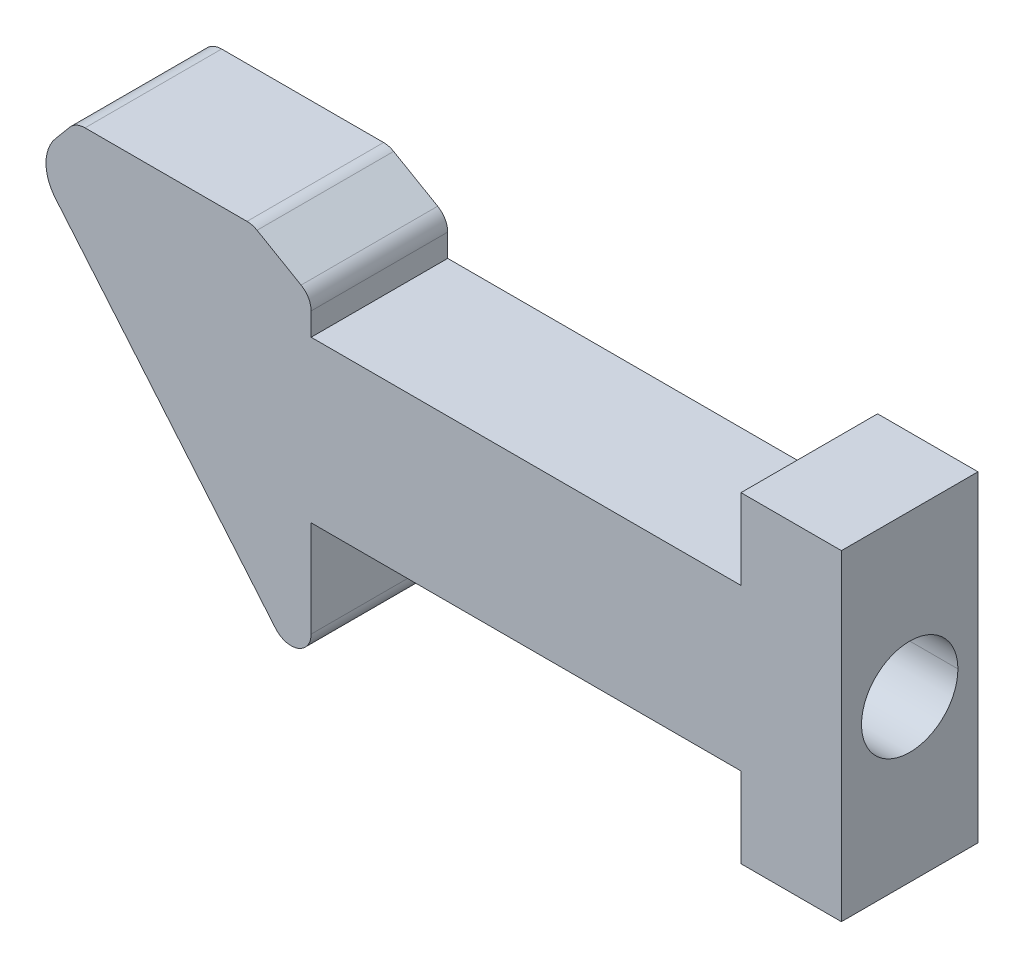
ISO-10303-21;
HEADER;
FILE_DESCRIPTION(('STEP AP214'),'2;1');
FILE_NAME('part.step','',(''),(''),'','','');
FILE_SCHEMA(('AUTOMOTIVE_DESIGN { 1 0 10303 214 1 1 1 1 }'));
ENDSEC;
DATA;
#1=APPLICATION_CONTEXT('core data for automotive mechanical design processes');
#2=APPLICATION_PROTOCOL_DEFINITION('international standard','automotive_design',2000,#1);
#3=PRODUCT_CONTEXT('',#1,'mechanical');
#4=PRODUCT('Part','Part','',(#3));
#5=PRODUCT_RELATED_PRODUCT_CATEGORY('part','',(#4));
#6=PRODUCT_DEFINITION_FORMATION('','',#4);
#7=PRODUCT_DEFINITION_CONTEXT('part definition',#1,'design');
#8=PRODUCT_DEFINITION('design','',#6,#7);
#9=PRODUCT_DEFINITION_SHAPE('','',#8);
#10=(LENGTH_UNIT() NAMED_UNIT(*) SI_UNIT(.MILLI.,.METRE.));
#11=(NAMED_UNIT(*) PLANE_ANGLE_UNIT() SI_UNIT($,.RADIAN.));
#12=(NAMED_UNIT(*) SI_UNIT($,.STERADIAN.) SOLID_ANGLE_UNIT());
#13=UNCERTAINTY_MEASURE_WITH_UNIT(LENGTH_MEASURE(1.E-05),#10,'distance_accuracy_value','');
#14=(GEOMETRIC_REPRESENTATION_CONTEXT(3) GLOBAL_UNCERTAINTY_ASSIGNED_CONTEXT((#13)) GLOBAL_UNIT_ASSIGNED_CONTEXT((#10,
#11,#12)) REPRESENTATION_CONTEXT('',''));
#15=CARTESIAN_POINT('',(0.,0.,0.));
#16=DIRECTION('',(0.,0.,1.));
#17=DIRECTION('',(1.,0.,0.));
#18=AXIS2_PLACEMENT_3D('',#15,#16,#17);
#19=CARTESIAN_POINT('',(-9.5,0.,0.));
#20=DIRECTION('',(1.,0.,0.));
#21=DIRECTION('',(0.,0.,-1.));
#22=AXIS2_PLACEMENT_3D('',#19,#20,#21);
#23=CYLINDRICAL_SURFACE('',#22,0.95);
#24=CARTESIAN_POINT('',(-9.5,0.,0.));
#25=DIRECTION('',(1.,0.,0.));
#26=DIRECTION('',(0.,0.,-1.));
#27=AXIS2_PLACEMENT_3D('',#24,#25,#26);
#28=CIRCLE('',#27,0.95);
#29=CARTESIAN_POINT('',(-9.5,0.,0.95));
#30=VERTEX_POINT('',#29);
#31=CARTESIAN_POINT('',(-9.5,0.,-0.95));
#32=VERTEX_POINT('',#31);
#33=EDGE_CURVE('E363',#30,#32,#28,.T.);
#34=ORIENTED_EDGE('',*,*,#33,.F.);
#35=DIRECTION('',(1.,0.,0.));
#36=VECTOR('',#35,1.);
#37=CARTESIAN_POINT('',(-9.5,0.,0.95));
#38=LINE('',#37,#36);
#39=CARTESIAN_POINT('',(-2.8,0.,0.95));
#40=VERTEX_POINT('',#39);
#41=EDGE_CURVE('E343',#30,#40,#38,.T.);
#42=ORIENTED_EDGE('',*,*,#41,.T.);
#43=CARTESIAN_POINT('',(-2.8,0.,0.));
#44=DIRECTION('',(-1.,0.,0.));
#45=DIRECTION('',(0.,0.,-1.));
#46=AXIS2_PLACEMENT_3D('',#43,#44,#45);
#47=CIRCLE('',#46,0.95);
#48=CARTESIAN_POINT('',(-2.8,0.,-0.95));
#49=VERTEX_POINT('',#48);
#50=EDGE_CURVE('E289',#49,#40,#47,.T.);
#51=ORIENTED_EDGE('',*,*,#50,.F.);
#52=DIRECTION('',(1.,0.,0.));
#53=VECTOR('',#52,1.);
#54=CARTESIAN_POINT('',(-9.5,0.,-0.95));
#55=LINE('',#54,#53);
#56=EDGE_CURVE('E364',#32,#49,#55,.T.);
#57=ORIENTED_EDGE('',*,*,#56,.F.);
#58=EDGE_LOOP('',(#34,#42,#51,#57));
#59=FACE_BOUND('',#58,.T.);
#60=ADVANCED_FACE('F15',(#59),#23,.F.);
#61=CARTESIAN_POINT('',(-2.8,0.,0.));
#62=DIRECTION('',(1.,0.,0.));
#63=DIRECTION('',(0.,0.,-1.));
#64=AXIS2_PLACEMENT_3D('',#61,#62,#63);
#65=CYLINDRICAL_SURFACE('',#64,1.2);
#66=CARTESIAN_POINT('',(-2.8,0.,0.));
#67=DIRECTION('',(1.,0.,0.));
#68=DIRECTION('',(0.,0.,-1.));
#69=AXIS2_PLACEMENT_3D('',#66,#67,#68);
#70=CIRCLE('',#69,1.2);
#71=CARTESIAN_POINT('',(-2.8,0.,1.2));
#72=VERTEX_POINT('',#71);
#73=CARTESIAN_POINT('',(-2.8,0.,-1.2));
#74=VERTEX_POINT('',#73);
#75=EDGE_CURVE('E286',#72,#74,#70,.T.);
#76=ORIENTED_EDGE('',*,*,#75,.F.);
#77=DIRECTION('',(1.,0.,0.));
#78=VECTOR('',#77,1.);
#79=CARTESIAN_POINT('',(-2.8,0.,1.2));
#80=LINE('',#79,#78);
#81=CARTESIAN_POINT('',(0.,0.,1.2));
#82=VERTEX_POINT('',#81);
#83=EDGE_CURVE('E503',#72,#82,#80,.T.);
#84=ORIENTED_EDGE('',*,*,#83,.T.);
#85=CARTESIAN_POINT('',(0.,0.,0.));
#86=DIRECTION('',(1.,0.,0.));
#87=DIRECTION('',(0.,0.,-1.));
#88=AXIS2_PLACEMENT_3D('',#85,#86,#87);
#89=CIRCLE('',#88,1.2);
#90=CARTESIAN_POINT('',(0.,0.,-1.2));
#91=VERTEX_POINT('',#90);
#92=EDGE_CURVE('E255',#82,#91,#89,.T.);
#93=ORIENTED_EDGE('',*,*,#92,.T.);
#94=DIRECTION('',(1.,0.,0.));
#95=VECTOR('',#94,1.);
#96=CARTESIAN_POINT('',(-2.8,0.,-1.2));
#97=LINE('',#96,#95);
#98=EDGE_CURVE('E304',#74,#91,#97,.T.);
#99=ORIENTED_EDGE('',*,*,#98,.F.);
#100=EDGE_LOOP('',(#76,#84,#93,#99));
#101=FACE_BOUND('',#100,.T.);
#102=ADVANCED_FACE('F800',(#101),#65,.F.);
#103=CARTESIAN_POINT('',(-18.8,2.45580523566075,1.7));
#104=DIRECTION('',(0.,0.,-1.));
#105=DIRECTION('',(-1.,0.,0.));
#106=AXIS2_PLACEMENT_3D('',#103,#104,#105);
#107=CYLINDRICAL_SURFACE('',#106,1.);
#108=CARTESIAN_POINT('',(-18.8,2.45580523566075,1.7));
#109=DIRECTION('',(0.,0.,1.));
#110=DIRECTION('',(-1.,0.,0.));
#111=AXIS2_PLACEMENT_3D('',#108,#109,#110);
#112=CIRCLE('',#111,1.);
#113=CARTESIAN_POINT('',(-19.8,2.45580523566075,1.7));
#114=VERTEX_POINT('',#113);
#115=CARTESIAN_POINT('',(-19.5660444431189,1.81301762597422,1.7));
#116=VERTEX_POINT('',#115);
#117=EDGE_CURVE('E423',#114,#116,#112,.T.);
#118=ORIENTED_EDGE('',*,*,#117,.F.);
#119=DIRECTION('',(0.,0.,-1.));
#120=VECTOR('',#119,1.);
#121=CARTESIAN_POINT('',(-19.8,2.45580523566075,1.7));
#122=LINE('',#121,#120);
#123=CARTESIAN_POINT('',(-19.8,2.45580523566075,-1.7));
#124=VERTEX_POINT('',#123);
#125=EDGE_CURVE('E10',#114,#124,#122,.T.);
#126=ORIENTED_EDGE('',*,*,#125,.T.);
#127=CARTESIAN_POINT('',(-18.8,2.45580523566075,-1.7));
#128=DIRECTION('',(0.,0.,1.));
#129=DIRECTION('',(-1.,0.,0.));
#130=AXIS2_PLACEMENT_3D('',#127,#128,#129);
#131=CIRCLE('',#130,1.);
#132=CARTESIAN_POINT('',(-19.5660444431189,1.81301762597422,-1.7));
#133=VERTEX_POINT('',#132);
#134=EDGE_CURVE('E306',#124,#133,#131,.T.);
#135=ORIENTED_EDGE('',*,*,#134,.T.);
#136=DIRECTION('',(0.,0.,-1.));
#137=VECTOR('',#136,1.);
#138=CARTESIAN_POINT('',(-19.5660444431189,1.81301762597422,1.7));
#139=LINE('',#138,#137);
#140=EDGE_CURVE('E26',#116,#133,#139,.T.);
#141=ORIENTED_EDGE('',*,*,#140,.F.);
#142=EDGE_LOOP('',(#118,#126,#135,#141));
#143=FACE_BOUND('',#142,.T.);
#144=ADVANCED_FACE('F17',(#143),#107,.T.);
#145=CARTESIAN_POINT('',(-18.8,2.45580523566075,1.7));
#146=DIRECTION('',(0.,0.,-1.));
#147=DIRECTION('',(-1.,0.,0.));
#148=AXIS2_PLACEMENT_3D('',#145,#146,#147);
#149=CYLINDRICAL_SURFACE('',#148,1.);
#150=ORIENTED_EDGE('',*,*,#125,.F.);
#151=CARTESIAN_POINT('',(-18.8,2.45580523566075,1.7));
#152=DIRECTION('',(0.,0.,1.));
#153=DIRECTION('',(-1.,0.,0.));
#154=AXIS2_PLACEMENT_3D('',#151,#152,#153);
#155=CIRCLE('',#154,1.);
#156=CARTESIAN_POINT('',(-19.566044443119,3.09859284534729,1.7));
#157=VERTEX_POINT('',#156);
#158=EDGE_CURVE('E310',#157,#114,#155,.T.);
#159=ORIENTED_EDGE('',*,*,#158,.F.);
#160=DIRECTION('',(0.,0.,-1.));
#161=VECTOR('',#160,1.);
#162=CARTESIAN_POINT('',(-19.566044443119,3.09859284534729,1.7));
#163=LINE('',#162,#161);
#164=CARTESIAN_POINT('',(-19.566044443119,3.09859284534729,-1.7));
#165=VERTEX_POINT('',#164);
#166=EDGE_CURVE('E389',#157,#165,#163,.T.);
#167=ORIENTED_EDGE('',*,*,#166,.T.);
#168=CARTESIAN_POINT('',(-18.8,2.45580523566075,-1.7));
#169=DIRECTION('',(0.,0.,1.));
#170=DIRECTION('',(-1.,0.,0.));
#171=AXIS2_PLACEMENT_3D('',#168,#169,#170);
#172=CIRCLE('',#171,1.);
#173=EDGE_CURVE('E297',#165,#124,#172,.T.);
#174=ORIENTED_EDGE('',*,*,#173,.T.);
#175=EDGE_LOOP('',(#150,#159,#167,#174));
#176=FACE_BOUND('',#175,.T.);
#177=ADVANCED_FACE('F483',(#176),#149,.T.);
#178=CARTESIAN_POINT('',(-19.5660444431189,1.81301762597422,1.7));
#179=DIRECTION('',(0.766044443118981,0.642787609686536,0.));
#180=DIRECTION('',(0.,0.,-1.));
#181=AXIS2_PLACEMENT_3D('',#178,#179,#180);
#182=PLANE('',#181);
#183=DIRECTION('',(0.642787609686535,-0.766044443118982,0.));
#184=VECTOR('',#183,1.);
#185=CARTESIAN_POINT('',(-19.5660444431189,1.81301762597422,-1.7));
#186=LINE('',#185,#184);
#187=CARTESIAN_POINT('',(-14.0830222215595,-4.72139380484327,-1.7));
#188=VERTEX_POINT('',#187);
#189=EDGE_CURVE('E311',#133,#188,#186,.T.);
#190=ORIENTED_EDGE('',*,*,#189,.T.);
#191=DIRECTION('',(0.,0.,-1.));
#192=VECTOR('',#191,1.);
#193=CARTESIAN_POINT('',(-14.0830222215595,-4.72139380484327,1.7));
#194=LINE('',#193,#192);
#195=CARTESIAN_POINT('',(-14.0830222215595,-4.72139380484327,1.7));
#196=VERTEX_POINT('',#195);
#197=EDGE_CURVE('E403',#196,#188,#194,.T.);
#198=ORIENTED_EDGE('',*,*,#197,.F.);
#199=DIRECTION('',(0.642787609686535,-0.766044443118982,0.));
#200=VECTOR('',#199,1.);
#201=CARTESIAN_POINT('',(-19.5660444431189,1.81301762597422,1.7));
#202=LINE('',#201,#200);
#203=EDGE_CURVE('E281',#116,#196,#202,.T.);
#204=ORIENTED_EDGE('',*,*,#203,.F.);
#205=ORIENTED_EDGE('',*,*,#140,.T.);
#206=EDGE_LOOP('',(#190,#198,#204,#205));
#207=FACE_BOUND('',#206,.T.);
#208=ADVANCED_FACE('F479',(#207),#182,.F.);
#209=CARTESIAN_POINT('',(-13.7,-4.4,1.7));
#210=DIRECTION('',(0.,0.,-1.));
#211=DIRECTION('',(-1.,0.,0.));
#212=AXIS2_PLACEMENT_3D('',#209,#210,#211);
#213=CYLINDRICAL_SURFACE('',#212,0.5);
#214=CARTESIAN_POINT('',(-13.7,-4.4,-1.7));
#215=DIRECTION('',(0.,0.,1.));
#216=DIRECTION('',(1.,0.,0.));
#217=AXIS2_PLACEMENT_3D('',#214,#215,#216);
#218=CIRCLE('',#217,0.5);
#219=CARTESIAN_POINT('',(-13.2,-4.4,-1.7));
#220=VERTEX_POINT('',#219);
#221=EDGE_CURVE('E294',#188,#220,#218,.T.);
#222=ORIENTED_EDGE('',*,*,#221,.T.);
#223=DIRECTION('',(0.,0.,-1.));
#224=VECTOR('',#223,1.);
#225=CARTESIAN_POINT('',(-13.2,-4.4,1.7));
#226=LINE('',#225,#224);
#227=CARTESIAN_POINT('',(-13.2,-4.4,1.7));
#228=VERTEX_POINT('',#227);
#229=EDGE_CURVE('E406',#228,#220,#226,.T.);
#230=ORIENTED_EDGE('',*,*,#229,.F.);
#231=CARTESIAN_POINT('',(-13.7,-4.4,1.7));
#232=DIRECTION('',(0.,0.,1.));
#233=DIRECTION('',(1.,0.,0.));
#234=AXIS2_PLACEMENT_3D('',#231,#232,#233);
#235=CIRCLE('',#234,0.5);
#236=EDGE_CURVE('E377',#196,#228,#235,.T.);
#237=ORIENTED_EDGE('',*,*,#236,.F.);
#238=ORIENTED_EDGE('',*,*,#197,.T.);
#239=EDGE_LOOP('',(#222,#230,#237,#238));
#240=FACE_BOUND('',#239,.T.);
#241=ADVANCED_FACE('F475',(#240),#213,.T.);
#242=CARTESIAN_POINT('',(-13.2,-4.4,1.7));
#243=DIRECTION('',(-1.,0.,0.));
#244=DIRECTION('',(0.,1.,0.));
#245=AXIS2_PLACEMENT_3D('',#242,#243,#244);
#246=PLANE('',#245);
#247=DIRECTION('',(0.,1.,0.));
#248=VECTOR('',#247,1.);
#249=CARTESIAN_POINT('',(-13.2,-4.4,-1.7));
#250=LINE('',#249,#248);
#251=CARTESIAN_POINT('',(-13.2,-2.,-1.7));
#252=VERTEX_POINT('',#251);
#253=EDGE_CURVE('E291',#220,#252,#250,.T.);
#254=ORIENTED_EDGE('',*,*,#253,.T.);
#255=DIRECTION('',(0.,0.,-1.));
#256=VECTOR('',#255,1.);
#257=CARTESIAN_POINT('',(-13.2,-2.,1.7));
#258=LINE('',#257,#256);
#259=CARTESIAN_POINT('',(-13.2,-2.,1.7));
#260=VERTEX_POINT('',#259);
#261=EDGE_CURVE('E229',#260,#252,#258,.T.);
#262=ORIENTED_EDGE('',*,*,#261,.F.);
#263=DIRECTION('',(0.,1.,0.));
#264=VECTOR('',#263,1.);
#265=CARTESIAN_POINT('',(-13.2,-4.4,1.7));
#266=LINE('',#265,#264);
#267=EDGE_CURVE('E380',#228,#260,#266,.T.);
#268=ORIENTED_EDGE('',*,*,#267,.F.);
#269=ORIENTED_EDGE('',*,*,#229,.T.);
#270=EDGE_LOOP('',(#254,#262,#268,#269));
#271=FACE_BOUND('',#270,.T.);
#272=ADVANCED_FACE('F469',(#271),#246,.F.);
#273=CARTESIAN_POINT('',(-13.2,-2.,1.7));
#274=DIRECTION('',(0.,1.,0.));
#275=DIRECTION('',(1.,0.,0.));
#276=AXIS2_PLACEMENT_3D('',#273,#274,#275);
#277=PLANE('',#276);
#278=DIRECTION('',(1.,0.,0.));
#279=VECTOR('',#278,1.);
#280=CARTESIAN_POINT('',(-13.2,-2.,-1.7));
#281=LINE('',#280,#279);
#282=CARTESIAN_POINT('',(-2.5,-2.,-1.7));
#283=VERTEX_POINT('',#282);
#284=EDGE_CURVE('E263',#252,#283,#281,.T.);
#285=ORIENTED_EDGE('',*,*,#284,.T.);
#286=DIRECTION('',(0.,0.,-1.));
#287=VECTOR('',#286,1.);
#288=CARTESIAN_POINT('',(-2.5,-2.,1.7));
#289=LINE('',#288,#287);
#290=CARTESIAN_POINT('',(-2.5,-2.,1.7));
#291=VERTEX_POINT('',#290);
#292=EDGE_CURVE('E237',#291,#283,#289,.T.);
#293=ORIENTED_EDGE('',*,*,#292,.F.);
#294=DIRECTION('',(1.,0.,0.));
#295=VECTOR('',#294,1.);
#296=CARTESIAN_POINT('',(-13.2,-2.,1.7));
#297=LINE('',#296,#295);
#298=EDGE_CURVE('E301',#260,#291,#297,.T.);
#299=ORIENTED_EDGE('',*,*,#298,.F.);
#300=ORIENTED_EDGE('',*,*,#261,.T.);
#301=EDGE_LOOP('',(#285,#293,#299,#300));
#302=FACE_BOUND('',#301,.T.);
#303=ADVANCED_FACE('F464',(#302),#277,.F.);
#304=CARTESIAN_POINT('',(-2.5,-4.,1.7));
#305=DIRECTION('',(1.,0.,0.));
#306=DIRECTION('',(0.,1.,0.));
#307=AXIS2_PLACEMENT_3D('',#304,#305,#306);
#308=PLANE('',#307);
#309=DIRECTION('',(0.,-1.,0.));
#310=VECTOR('',#309,1.);
#311=CARTESIAN_POINT('',(-2.5,-4.,-1.7));
#312=LINE('',#311,#310);
#313=CARTESIAN_POINT('',(-2.5,-4.,-1.7));
#314=VERTEX_POINT('',#313);
#315=EDGE_CURVE('E258',#283,#314,#312,.T.);
#316=ORIENTED_EDGE('',*,*,#315,.T.);
#317=DIRECTION('',(0.,0.,-1.));
#318=VECTOR('',#317,1.);
#319=CARTESIAN_POINT('',(-2.5,-4.,1.7));
#320=LINE('',#319,#318);
#321=CARTESIAN_POINT('',(-2.5,-4.,1.7));
#322=VERTEX_POINT('',#321);
#323=EDGE_CURVE('E246',#322,#314,#320,.T.);
#324=ORIENTED_EDGE('',*,*,#323,.F.);
#325=DIRECTION('',(0.,-1.,0.));
#326=VECTOR('',#325,1.);
#327=CARTESIAN_POINT('',(-2.5,-4.,1.7));
#328=LINE('',#327,#326);
#329=EDGE_CURVE('E298',#291,#322,#328,.T.);
#330=ORIENTED_EDGE('',*,*,#329,.F.);
#331=ORIENTED_EDGE('',*,*,#292,.T.);
#332=EDGE_LOOP('',(#316,#324,#330,#331));
#333=FACE_BOUND('',#332,.T.);
#334=ADVANCED_FACE('F259',(#333),#308,.F.);
#335=CARTESIAN_POINT('',(0.,-4.,1.7));
#336=DIRECTION('',(0.,1.,0.));
#337=DIRECTION('',(1.,0.,0.));
#338=AXIS2_PLACEMENT_3D('',#335,#336,#337);
#339=PLANE('',#338);
#340=DIRECTION('',(1.,0.,0.));
#341=VECTOR('',#340,1.);
#342=CARTESIAN_POINT('',(0.,-4.,-1.7));
#343=LINE('',#342,#341);
#344=CARTESIAN_POINT('',(0.,-4.,-1.7));
#345=VERTEX_POINT('',#344);
#346=EDGE_CURVE('E249',#314,#345,#343,.T.);
#347=ORIENTED_EDGE('',*,*,#346,.T.);
#348=DIRECTION('',(0.,0.,-1.));
#349=VECTOR('',#348,1.);
#350=CARTESIAN_POINT('',(0.,-4.,1.7));
#351=LINE('',#350,#349);
#352=CARTESIAN_POINT('',(0.,-4.,1.7));
#353=VERTEX_POINT('',#352);
#354=EDGE_CURVE('E313',#353,#345,#351,.T.);
#355=ORIENTED_EDGE('',*,*,#354,.F.);
#356=DIRECTION('',(1.,0.,0.));
#357=VECTOR('',#356,1.);
#358=CARTESIAN_POINT('',(0.,-4.,1.7));
#359=LINE('',#358,#357);
#360=EDGE_CURVE('E252',#322,#353,#359,.T.);
#361=ORIENTED_EDGE('',*,*,#360,.F.);
#362=ORIENTED_EDGE('',*,*,#323,.T.);
#363=EDGE_LOOP('',(#347,#355,#361,#362));
#364=FACE_BOUND('',#363,.T.);
#365=ADVANCED_FACE('F247',(#364),#339,.F.);
#366=CARTESIAN_POINT('',(0.,4.,1.7));
#367=DIRECTION('',(-1.,0.,0.));
#368=DIRECTION('',(0.,0.,1.));
#369=AXIS2_PLACEMENT_3D('',#366,#367,#368);
#370=PLANE('',#369);
#371=CARTESIAN_POINT('',(0.,0.,0.));
#372=DIRECTION('',(1.,0.,0.));
#373=DIRECTION('',(0.,0.,-1.));
#374=AXIS2_PLACEMENT_3D('',#371,#372,#373);
#375=CIRCLE('',#374,1.2);
#376=EDGE_CURVE('E290',#91,#82,#375,.T.);
#377=ORIENTED_EDGE('',*,*,#376,.F.);
#378=ORIENTED_EDGE('',*,*,#92,.F.);
#379=EDGE_LOOP('',(#377,#378));
#380=FACE_BOUND('',#379,.T.);
#381=DIRECTION('',(0.,1.,0.));
#382=VECTOR('',#381,1.);
#383=CARTESIAN_POINT('',(0.,4.,-1.7));
#384=LINE('',#383,#382);
#385=CARTESIAN_POINT('',(0.,4.,-1.7));
#386=VERTEX_POINT('',#385);
#387=EDGE_CURVE('E269',#345,#386,#384,.T.);
#388=ORIENTED_EDGE('',*,*,#387,.T.);
#389=DIRECTION('',(0.,0.,-1.));
#390=VECTOR('',#389,1.);
#391=CARTESIAN_POINT('',(0.,4.,1.7));
#392=LINE('',#391,#390);
#393=CARTESIAN_POINT('',(0.,4.,1.7));
#394=VERTEX_POINT('',#393);
#395=EDGE_CURVE('E365',#394,#386,#392,.T.);
#396=ORIENTED_EDGE('',*,*,#395,.F.);
#397=DIRECTION('',(0.,1.,0.));
#398=VECTOR('',#397,1.);
#399=CARTESIAN_POINT('',(0.,4.,1.7));
#400=LINE('',#399,#398);
#401=EDGE_CURVE('E416',#353,#394,#400,.T.);
#402=ORIENTED_EDGE('',*,*,#401,.F.);
#403=ORIENTED_EDGE('',*,*,#354,.T.);
#404=EDGE_LOOP('',(#388,#396,#402,#403));
#405=FACE_BOUND('',#404,.T.);
#406=ADVANCED_FACE('F744',(#380,#405),#370,.F.);
#407=CARTESIAN_POINT('',(-2.5,4.,1.7));
#408=DIRECTION('',(0.,-1.,0.));
#409=DIRECTION('',(0.,0.,-1.));
#410=AXIS2_PLACEMENT_3D('',#407,#408,#409);
#411=PLANE('',#410);
#412=DIRECTION('',(-1.,0.,0.));
#413=VECTOR('',#412,1.);
#414=CARTESIAN_POINT('',(-2.5,4.,-1.7));
#415=LINE('',#414,#413);
#416=CARTESIAN_POINT('',(-2.5,4.,-1.7));
#417=VERTEX_POINT('',#416);
#418=EDGE_CURVE('E277',#386,#417,#415,.T.);
#419=ORIENTED_EDGE('',*,*,#418,.T.);
#420=DIRECTION('',(0.,0.,-1.));
#421=VECTOR('',#420,1.);
#422=CARTESIAN_POINT('',(-2.5,4.,1.7));
#423=LINE('',#422,#421);
#424=CARTESIAN_POINT('',(-2.5,4.,1.7));
#425=VERTEX_POINT('',#424);
#426=EDGE_CURVE('E342',#425,#417,#423,.T.);
#427=ORIENTED_EDGE('',*,*,#426,.F.);
#428=DIRECTION('',(-1.,0.,0.));
#429=VECTOR('',#428,1.);
#430=CARTESIAN_POINT('',(-2.5,4.,1.7));
#431=LINE('',#430,#429);
#432=EDGE_CURVE('E451',#394,#425,#431,.T.);
#433=ORIENTED_EDGE('',*,*,#432,.F.);
#434=ORIENTED_EDGE('',*,*,#395,.T.);
#435=EDGE_LOOP('',(#419,#427,#433,#434));
#436=FACE_BOUND('',#435,.T.);
#437=ADVANCED_FACE('F716',(#436),#411,.F.);
#438=CARTESIAN_POINT('',(-2.5,2.,1.7));
#439=DIRECTION('',(1.,0.,0.));
#440=DIRECTION('',(0.,-1.,0.));
#441=AXIS2_PLACEMENT_3D('',#438,#439,#440);
#442=PLANE('',#441);
#443=DIRECTION('',(0.,-1.,0.));
#444=VECTOR('',#443,1.);
#445=CARTESIAN_POINT('',(-2.5,2.,-1.7));
#446=LINE('',#445,#444);
#447=CARTESIAN_POINT('',(-2.5,2.,-1.7));
#448=VERTEX_POINT('',#447);
#449=EDGE_CURVE('E429',#417,#448,#446,.T.);
#450=ORIENTED_EDGE('',*,*,#449,.T.);
#451=DIRECTION('',(0.,0.,-1.));
#452=VECTOR('',#451,1.);
#453=CARTESIAN_POINT('',(-2.5,2.,1.7));
#454=LINE('',#453,#452);
#455=CARTESIAN_POINT('',(-2.5,2.,1.7));
#456=VERTEX_POINT('',#455);
#457=EDGE_CURVE('E358',#456,#448,#454,.T.);
#458=ORIENTED_EDGE('',*,*,#457,.F.);
#459=DIRECTION('',(0.,-1.,0.));
#460=VECTOR('',#459,1.);
#461=CARTESIAN_POINT('',(-2.5,2.,1.7));
#462=LINE('',#461,#460);
#463=EDGE_CURVE('E444',#425,#456,#462,.T.);
#464=ORIENTED_EDGE('',*,*,#463,.F.);
#465=ORIENTED_EDGE('',*,*,#426,.T.);
#466=EDGE_LOOP('',(#450,#458,#464,#465));
#467=FACE_BOUND('',#466,.T.);
#468=ADVANCED_FACE('F711',(#467),#442,.F.);
#469=CARTESIAN_POINT('',(-13.2,2.,1.7));
#470=DIRECTION('',(0.,-1.,0.));
#471=DIRECTION('',(0.,0.,-1.));
#472=AXIS2_PLACEMENT_3D('',#469,#470,#471);
#473=PLANE('',#472);
#474=DIRECTION('',(-1.,0.,0.));
#475=VECTOR('',#474,1.);
#476=CARTESIAN_POINT('',(-13.2,2.,-1.7));
#477=LINE('',#476,#475);
#478=CARTESIAN_POINT('',(-13.2,2.,-1.7));
#479=VERTEX_POINT('',#478);
#480=EDGE_CURVE('E430',#448,#479,#477,.T.);
#481=ORIENTED_EDGE('',*,*,#480,.T.);
#482=DIRECTION('',(0.,0.,-1.));
#483=VECTOR('',#482,1.);
#484=CARTESIAN_POINT('',(-13.2,2.,1.7));
#485=LINE('',#484,#483);
#486=CARTESIAN_POINT('',(-13.2,2.,1.7));
#487=VERTEX_POINT('',#486);
#488=EDGE_CURVE('E285',#487,#479,#485,.T.);
#489=ORIENTED_EDGE('',*,*,#488,.F.);
#490=DIRECTION('',(-1.,0.,0.));
#491=VECTOR('',#490,1.);
#492=CARTESIAN_POINT('',(-13.2,2.,1.7));
#493=LINE('',#492,#491);
#494=EDGE_CURVE('E413',#456,#487,#493,.T.);
#495=ORIENTED_EDGE('',*,*,#494,.F.);
#496=ORIENTED_EDGE('',*,*,#457,.T.);
#497=EDGE_LOOP('',(#481,#489,#495,#496));
#498=FACE_BOUND('',#497,.T.);
#499=ADVANCED_FACE('F715',(#498),#473,.F.);
#500=CARTESIAN_POINT('',(-13.2,2.,1.7));
#501=DIRECTION('',(-1.,0.,0.));
#502=DIRECTION('',(0.,1.,0.));
#503=AXIS2_PLACEMENT_3D('',#500,#501,#502);
#504=PLANE('',#503);
#505=DIRECTION('',(0.,1.,0.));
#506=VECTOR('',#505,1.);
#507=CARTESIAN_POINT('',(-13.2,2.,-1.7));
#508=LINE('',#507,#506);
#509=CARTESIAN_POINT('',(-13.2,2.56698729810777,-1.7));
#510=VERTEX_POINT('',#509);
#511=EDGE_CURVE('E434',#479,#510,#508,.T.);
#512=ORIENTED_EDGE('',*,*,#511,.T.);
#513=DIRECTION('',(0.,0.,-1.));
#514=VECTOR('',#513,1.);
#515=CARTESIAN_POINT('',(-13.2,2.56698729810777,1.7));
#516=LINE('',#515,#514);
#517=CARTESIAN_POINT('',(-13.2,2.56698729810777,1.7));
#518=VERTEX_POINT('',#517);
#519=EDGE_CURVE('E283',#518,#510,#516,.T.);
#520=ORIENTED_EDGE('',*,*,#519,.F.);
#521=DIRECTION('',(0.,1.,0.));
#522=VECTOR('',#521,1.);
#523=CARTESIAN_POINT('',(-13.2,2.,1.7));
#524=LINE('',#523,#522);
#525=EDGE_CURVE('E375',#487,#518,#524,.T.);
#526=ORIENTED_EDGE('',*,*,#525,.F.);
#527=ORIENTED_EDGE('',*,*,#488,.T.);
#528=EDGE_LOOP('',(#512,#520,#526,#527));
#529=FACE_BOUND('',#528,.T.);
#530=ADVANCED_FACE('F818',(#529),#504,.F.);
#531=CARTESIAN_POINT('',(-13.7,2.56698729810777,1.7));
#532=DIRECTION('',(0.,0.,-1.));
#533=DIRECTION('',(-1.,0.,0.));
#534=AXIS2_PLACEMENT_3D('',#531,#532,#533);
#535=CYLINDRICAL_SURFACE('',#534,0.500000000000007);
#536=CARTESIAN_POINT('',(-13.7,2.56698729810777,-1.7));
#537=DIRECTION('',(0.,0.,1.));
#538=DIRECTION('',(1.,0.,0.));
#539=AXIS2_PLACEMENT_3D('',#536,#537,#538);
#540=CIRCLE('',#539,0.500000000000007);
#541=CARTESIAN_POINT('',(-13.45,3.,-1.7));
#542=VERTEX_POINT('',#541);
#543=EDGE_CURVE('E19',#510,#542,#540,.T.);
#544=ORIENTED_EDGE('',*,*,#543,.T.);
#545=DIRECTION('',(0.,0.,-1.));
#546=VECTOR('',#545,1.);
#547=CARTESIAN_POINT('',(-13.45,3.,1.7));
#548=LINE('',#547,#546);
#549=CARTESIAN_POINT('',(-13.45,3.,1.7));
#550=VERTEX_POINT('',#549);
#551=EDGE_CURVE('E202',#550,#542,#548,.T.);
#552=ORIENTED_EDGE('',*,*,#551,.F.);
#553=CARTESIAN_POINT('',(-13.7,2.56698729810777,1.7));
#554=DIRECTION('',(0.,0.,1.));
#555=DIRECTION('',(1.,0.,0.));
#556=AXIS2_PLACEMENT_3D('',#553,#554,#555);
#557=CIRCLE('',#556,0.500000000000007);
#558=EDGE_CURVE('E371',#518,#550,#557,.T.);
#559=ORIENTED_EDGE('',*,*,#558,.F.);
#560=ORIENTED_EDGE('',*,*,#519,.T.);
#561=EDGE_LOOP('',(#544,#552,#559,#560));
#562=FACE_BOUND('',#561,.T.);
#563=ADVANCED_FACE('F814',(#562),#535,.T.);
#564=CARTESIAN_POINT('',(-13.45,3.,1.7));
#565=DIRECTION('',(-0.5,-0.866025403784439,0.));
#566=DIRECTION('',(-0.866025403784439,0.5,0.));
#567=AXIS2_PLACEMENT_3D('',#564,#565,#566);
#568=PLANE('',#567);
#569=DIRECTION('',(-0.866025403784439,0.5,0.));
#570=VECTOR('',#569,1.);
#571=CARTESIAN_POINT('',(-13.45,3.,-1.7));
#572=LINE('',#571,#570);
#573=CARTESIAN_POINT('',(-14.5464101615138,3.63301270189222,-1.7));
#574=VERTEX_POINT('',#573);
#575=EDGE_CURVE('E327',#542,#574,#572,.T.);
#576=ORIENTED_EDGE('',*,*,#575,.T.);
#577=DIRECTION('',(0.,0.,-1.));
#578=VECTOR('',#577,1.);
#579=CARTESIAN_POINT('',(-14.5464101615138,3.63301270189222,1.7));
#580=LINE('',#579,#578);
#581=CARTESIAN_POINT('',(-14.5464101615138,3.63301270189222,1.7));
#582=VERTEX_POINT('',#581);
#583=EDGE_CURVE('E213',#582,#574,#580,.T.);
#584=ORIENTED_EDGE('',*,*,#583,.F.);
#585=DIRECTION('',(-0.866025403784439,0.5,0.));
#586=VECTOR('',#585,1.);
#587=CARTESIAN_POINT('',(-13.45,3.,1.7));
#588=LINE('',#587,#586);
#589=EDGE_CURVE('E374',#550,#582,#588,.T.);
#590=ORIENTED_EDGE('',*,*,#589,.F.);
#591=ORIENTED_EDGE('',*,*,#551,.T.);
#592=EDGE_LOOP('',(#576,#584,#590,#591));
#593=FACE_BOUND('',#592,.T.);
#594=ADVANCED_FACE('F494',(#593),#568,.F.);
#595=CARTESIAN_POINT('',(-14.7964101615138,3.2,1.7));
#596=DIRECTION('',(0.,0.,-1.));
#597=DIRECTION('',(-1.,0.,0.));
#598=AXIS2_PLACEMENT_3D('',#595,#596,#597);
#599=CYLINDRICAL_SURFACE('',#598,0.5);
#600=CARTESIAN_POINT('',(-14.7964101615138,3.2,-1.7));
#601=DIRECTION('',(0.,0.,1.));
#602=DIRECTION('',(1.,0.,0.));
#603=AXIS2_PLACEMENT_3D('',#600,#601,#602);
#604=CIRCLE('',#603,0.5);
#605=CARTESIAN_POINT('',(-14.7964101615138,3.7,-1.7));
#606=VERTEX_POINT('',#605);
#607=EDGE_CURVE('E317',#574,#606,#604,.T.);
#608=ORIENTED_EDGE('',*,*,#607,.T.);
#609=DIRECTION('',(0.,0.,-1.));
#610=VECTOR('',#609,1.);
#611=CARTESIAN_POINT('',(-14.7964101615138,3.7,1.7));
#612=LINE('',#611,#610);
#613=CARTESIAN_POINT('',(-14.7964101615138,3.7,1.7));
#614=VERTEX_POINT('',#613);
#615=EDGE_CURVE('E355',#614,#606,#612,.T.);
#616=ORIENTED_EDGE('',*,*,#615,.F.);
#617=CARTESIAN_POINT('',(-14.7964101615138,3.2,1.7));
#618=DIRECTION('',(0.,0.,1.));
#619=DIRECTION('',(1.,0.,0.));
#620=AXIS2_PLACEMENT_3D('',#617,#618,#619);
#621=CIRCLE('',#620,0.5);
#622=EDGE_CURVE('E382',#582,#614,#621,.T.);
#623=ORIENTED_EDGE('',*,*,#622,.F.);
#624=ORIENTED_EDGE('',*,*,#583,.T.);
#625=EDGE_LOOP('',(#608,#616,#623,#624));
#626=FACE_BOUND('',#625,.T.);
#627=ADVANCED_FACE('F492',(#626),#599,.T.);
#628=CARTESIAN_POINT('',(-18.828250092385,3.7,1.7));
#629=DIRECTION('',(0.,-1.,0.));
#630=DIRECTION('',(0.,0.,-1.));
#631=AXIS2_PLACEMENT_3D('',#628,#629,#630);
#632=PLANE('',#631);
#633=DIRECTION('',(-1.,0.,0.));
#634=VECTOR('',#633,1.);
#635=CARTESIAN_POINT('',(-18.828250092385,3.7,-1.7));
#636=LINE('',#635,#634);
#637=CARTESIAN_POINT('',(-18.828250092385,3.7,-1.7));
#638=VERTEX_POINT('',#637);
#639=EDGE_CURVE('E314',#606,#638,#636,.T.);
#640=ORIENTED_EDGE('',*,*,#639,.T.);
#641=DIRECTION('',(0.,0.,-1.));
#642=VECTOR('',#641,1.);
#643=CARTESIAN_POINT('',(-18.828250092385,3.7,1.7));
#644=LINE('',#643,#642);
#645=CARTESIAN_POINT('',(-18.828250092385,3.7,1.7));
#646=VERTEX_POINT('',#645);
#647=EDGE_CURVE('E435',#646,#638,#644,.T.);
#648=ORIENTED_EDGE('',*,*,#647,.F.);
#649=DIRECTION('',(-1.,0.,0.));
#650=VECTOR('',#649,1.);
#651=CARTESIAN_POINT('',(-18.828250092385,3.7,1.7));
#652=LINE('',#651,#650);
#653=EDGE_CURVE('E352',#614,#646,#652,.T.);
#654=ORIENTED_EDGE('',*,*,#653,.F.);
#655=ORIENTED_EDGE('',*,*,#615,.T.);
#656=EDGE_LOOP('',(#640,#648,#654,#655));
#657=FACE_BOUND('',#656,.T.);
#658=ADVANCED_FACE('F753',(#657),#632,.F.);
#659=CARTESIAN_POINT('',(-18.828250092385,3.2,1.7));
#660=DIRECTION('',(0.,0.,-1.));
#661=DIRECTION('',(-1.,0.,0.));
#662=AXIS2_PLACEMENT_3D('',#659,#660,#661);
#663=CYLINDRICAL_SURFACE('',#662,0.5);
#664=CARTESIAN_POINT('',(-18.828250092385,3.2,-1.7));
#665=DIRECTION('',(0.,0.,1.));
#666=DIRECTION('',(1.,0.,0.));
#667=AXIS2_PLACEMENT_3D('',#664,#665,#666);
#668=CIRCLE('',#667,0.5);
#669=CARTESIAN_POINT('',(-19.2112723139445,3.52139380484327,-1.7));
#670=VERTEX_POINT('',#669);
#671=EDGE_CURVE('E318',#638,#670,#668,.T.);
#672=ORIENTED_EDGE('',*,*,#671,.T.);
#673=DIRECTION('',(0.,0.,-1.));
#674=VECTOR('',#673,1.);
#675=CARTESIAN_POINT('',(-19.2112723139445,3.52139380484327,1.7));
#676=LINE('',#675,#674);
#677=CARTESIAN_POINT('',(-19.2112723139445,3.52139380484327,1.7));
#678=VERTEX_POINT('',#677);
#679=EDGE_CURVE('E41',#678,#670,#676,.T.);
#680=ORIENTED_EDGE('',*,*,#679,.F.);
#681=CARTESIAN_POINT('',(-18.828250092385,3.2,1.7));
#682=DIRECTION('',(0.,0.,1.));
#683=DIRECTION('',(1.,0.,0.));
#684=AXIS2_PLACEMENT_3D('',#681,#682,#683);
#685=CIRCLE('',#684,0.5);
#686=EDGE_CURVE('E347',#646,#678,#685,.T.);
#687=ORIENTED_EDGE('',*,*,#686,.F.);
#688=ORIENTED_EDGE('',*,*,#647,.T.);
#689=EDGE_LOOP('',(#672,#680,#687,#688));
#690=FACE_BOUND('',#689,.T.);
#691=ADVANCED_FACE('F736',(#690),#663,.T.);
#692=CARTESIAN_POINT('',(-19.566044443119,3.09859284534729,1.7));
#693=DIRECTION('',(0.766044443118985,-0.642787609686531,0.));
#694=DIRECTION('',(0.,0.,-1.));
#695=AXIS2_PLACEMENT_3D('',#692,#693,#694);
#696=PLANE('',#695);
#697=DIRECTION('',(-0.642787609686531,-0.766044443118985,0.));
#698=VECTOR('',#697,1.);
#699=CARTESIAN_POINT('',(-19.566044443119,3.09859284534729,-1.7));
#700=LINE('',#699,#698);
#701=EDGE_CURVE('E330',#670,#165,#700,.T.);
#702=ORIENTED_EDGE('',*,*,#701,.T.);
#703=ORIENTED_EDGE('',*,*,#166,.F.);
#704=DIRECTION('',(-0.642787609686531,-0.766044443118985,0.));
#705=VECTOR('',#704,1.);
#706=CARTESIAN_POINT('',(-19.566044443119,3.09859284534729,1.7));
#707=LINE('',#706,#705);
#708=EDGE_CURVE('E351',#678,#157,#707,.T.);
#709=ORIENTED_EDGE('',*,*,#708,.F.);
#710=ORIENTED_EDGE('',*,*,#679,.T.);
#711=EDGE_LOOP('',(#702,#703,#709,#710));
#712=FACE_BOUND('',#711,.T.);
#713=ADVANCED_FACE('F487',(#712),#696,.F.);
#714=CARTESIAN_POINT('',(-18.8,2.45580523566075,1.7));
#715=DIRECTION('',(0.,0.,-1.));
#716=DIRECTION('',(0.,-1.,0.));
#717=AXIS2_PLACEMENT_3D('',#714,#715,#716);
#718=PLANE('',#717);
#719=ORIENTED_EDGE('',*,*,#158,.T.);
#720=ORIENTED_EDGE('',*,*,#117,.T.);
#721=ORIENTED_EDGE('',*,*,#203,.T.);
#722=ORIENTED_EDGE('',*,*,#236,.T.);
#723=ORIENTED_EDGE('',*,*,#267,.T.);
#724=ORIENTED_EDGE('',*,*,#298,.T.);
#725=ORIENTED_EDGE('',*,*,#329,.T.);
#726=ORIENTED_EDGE('',*,*,#360,.T.);
#727=ORIENTED_EDGE('',*,*,#401,.T.);
#728=ORIENTED_EDGE('',*,*,#432,.T.);
#729=ORIENTED_EDGE('',*,*,#463,.T.);
#730=ORIENTED_EDGE('',*,*,#494,.T.);
#731=ORIENTED_EDGE('',*,*,#525,.T.);
#732=ORIENTED_EDGE('',*,*,#558,.T.);
#733=ORIENTED_EDGE('',*,*,#589,.T.);
#734=ORIENTED_EDGE('',*,*,#622,.T.);
#735=ORIENTED_EDGE('',*,*,#653,.T.);
#736=ORIENTED_EDGE('',*,*,#686,.T.);
#737=ORIENTED_EDGE('',*,*,#708,.T.);
#738=EDGE_LOOP('',(#719,#720,#721,#722,#723,#724,#725,#726,#727,#728,#729,#730,#731,#732,#733,
#734,#735,#736,#737));
#739=FACE_BOUND('',#738,.T.);
#740=ADVANCED_FACE('F735',(#739),#718,.F.);
#741=CARTESIAN_POINT('',(-18.8,2.45580523566075,-1.7));
#742=DIRECTION('',(0.,0.,-1.));
#743=DIRECTION('',(0.,-1.,0.));
#744=AXIS2_PLACEMENT_3D('',#741,#742,#743);
#745=PLANE('',#744);
#746=ORIENTED_EDGE('',*,*,#173,.F.);
#747=ORIENTED_EDGE('',*,*,#701,.F.);
#748=ORIENTED_EDGE('',*,*,#671,.F.);
#749=ORIENTED_EDGE('',*,*,#639,.F.);
#750=ORIENTED_EDGE('',*,*,#607,.F.);
#751=ORIENTED_EDGE('',*,*,#575,.F.);
#752=ORIENTED_EDGE('',*,*,#543,.F.);
#753=ORIENTED_EDGE('',*,*,#511,.F.);
#754=ORIENTED_EDGE('',*,*,#480,.F.);
#755=ORIENTED_EDGE('',*,*,#449,.F.);
#756=ORIENTED_EDGE('',*,*,#418,.F.);
#757=ORIENTED_EDGE('',*,*,#387,.F.);
#758=ORIENTED_EDGE('',*,*,#346,.F.);
#759=ORIENTED_EDGE('',*,*,#315,.F.);
#760=ORIENTED_EDGE('',*,*,#284,.F.);
#761=ORIENTED_EDGE('',*,*,#253,.F.);
#762=ORIENTED_EDGE('',*,*,#221,.F.);
#763=ORIENTED_EDGE('',*,*,#189,.F.);
#764=ORIENTED_EDGE('',*,*,#134,.F.);
#765=EDGE_LOOP('',(#746,#747,#748,#749,#750,#751,#752,#753,#754,#755,#756,#757,#758,#759,#760,
#761,#762,#763,#764));
#766=FACE_BOUND('',#765,.T.);
#767=ADVANCED_FACE('F266',(#766),#745,.T.);
#768=CARTESIAN_POINT('',(-2.8,0.,0.));
#769=DIRECTION('',(1.,0.,0.));
#770=DIRECTION('',(0.,1.,0.));
#771=AXIS2_PLACEMENT_3D('',#768,#769,#770);
#772=PLANE('',#771);
#773=ORIENTED_EDGE('',*,*,#50,.T.);
#774=CARTESIAN_POINT('',(-2.8,0.,0.));
#775=DIRECTION('',(-1.,0.,0.));
#776=DIRECTION('',(0.,0.,-1.));
#777=AXIS2_PLACEMENT_3D('',#774,#775,#776);
#778=CIRCLE('',#777,0.95);
#779=EDGE_CURVE('E359',#40,#49,#778,.T.);
#780=ORIENTED_EDGE('',*,*,#779,.T.);
#781=EDGE_LOOP('',(#773,#780));
#782=FACE_BOUND('',#781,.T.);
#783=CARTESIAN_POINT('',(-2.8,0.,0.));
#784=DIRECTION('',(1.,0.,0.));
#785=DIRECTION('',(0.,0.,-1.));
#786=AXIS2_PLACEMENT_3D('',#783,#784,#785);
#787=CIRCLE('',#786,1.2);
#788=EDGE_CURVE('E506',#74,#72,#787,.T.);
#789=ORIENTED_EDGE('',*,*,#788,.T.);
#790=ORIENTED_EDGE('',*,*,#75,.T.);
#791=EDGE_LOOP('',(#789,#790));
#792=FACE_BOUND('',#791,.T.);
#793=ADVANCED_FACE('F765',(#782,#792),#772,.T.);
#794=CARTESIAN_POINT('',(-2.8,0.,0.));
#795=DIRECTION('',(1.,0.,0.));
#796=DIRECTION('',(0.,0.,-1.));
#797=AXIS2_PLACEMENT_3D('',#794,#795,#796);
#798=CYLINDRICAL_SURFACE('',#797,1.2);
#799=ORIENTED_EDGE('',*,*,#83,.F.);
#800=ORIENTED_EDGE('',*,*,#788,.F.);
#801=ORIENTED_EDGE('',*,*,#98,.T.);
#802=ORIENTED_EDGE('',*,*,#376,.T.);
#803=EDGE_LOOP('',(#799,#800,#801,#802));
#804=FACE_BOUND('',#803,.T.);
#805=ADVANCED_FACE('F769',(#804),#798,.F.);
#806=CARTESIAN_POINT('',(-9.5,0.,0.));
#807=DIRECTION('',(1.,0.,0.));
#808=DIRECTION('',(0.,1.,0.));
#809=AXIS2_PLACEMENT_3D('',#806,#807,#808);
#810=PLANE('',#809);
#811=CARTESIAN_POINT('',(-9.5,0.,0.));
#812=DIRECTION('',(1.,0.,0.));
#813=DIRECTION('',(0.,0.,-1.));
#814=AXIS2_PLACEMENT_3D('',#811,#812,#813);
#815=CIRCLE('',#814,0.95);
#816=EDGE_CURVE('E345',#32,#30,#815,.T.);
#817=ORIENTED_EDGE('',*,*,#816,.T.);
#818=ORIENTED_EDGE('',*,*,#33,.T.);
#819=EDGE_LOOP('',(#817,#818));
#820=FACE_BOUND('',#819,.T.);
#821=ADVANCED_FACE('F726',(#820),#810,.T.);
#822=CARTESIAN_POINT('',(-9.5,0.,0.));
#823=DIRECTION('',(1.,0.,0.));
#824=DIRECTION('',(0.,0.,-1.));
#825=AXIS2_PLACEMENT_3D('',#822,#823,#824);
#826=CYLINDRICAL_SURFACE('',#825,0.95);
#827=ORIENTED_EDGE('',*,*,#41,.F.);
#828=ORIENTED_EDGE('',*,*,#816,.F.);
#829=ORIENTED_EDGE('',*,*,#56,.T.);
#830=ORIENTED_EDGE('',*,*,#779,.F.);
#831=EDGE_LOOP('',(#827,#828,#829,#830));
#832=FACE_BOUND('',#831,.T.);
#833=ADVANCED_FACE('F722',(#832),#826,.F.);
#834=CLOSED_SHELL('',(#60,#102,#144,#177,#208,#241,#272,#303,#334,#365,#406,#437,#468,#499,#530,
#563,#594,#627,#658,#691,#713,#740,#767,#793,#805,#821,#833));
#835=MANIFOLD_SOLID_BREP('B1',#834);
#836=ADVANCED_BREP_SHAPE_REPRESENTATION('',(#18,#835),#14);
#837=SHAPE_DEFINITION_REPRESENTATION(#9,#836);
ENDSEC;
END-ISO-10303-21;
